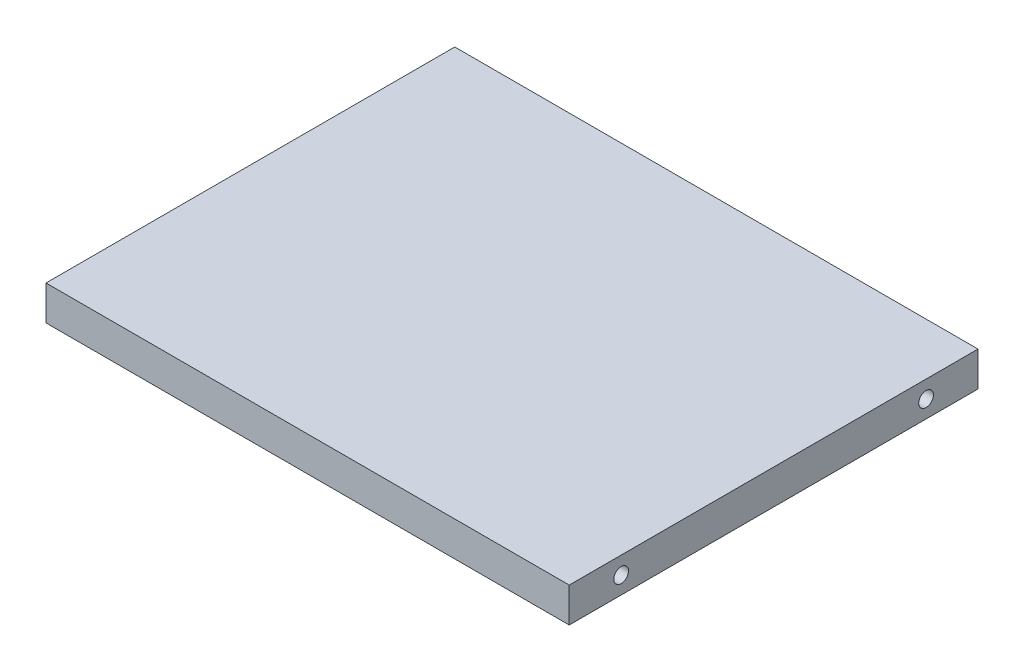
ISO-10303-21;
HEADER;
FILE_DESCRIPTION(('STEP AP214'),'2;1');
FILE_NAME('part.step','',(''),(''),'','','');
FILE_SCHEMA(('AUTOMOTIVE_DESIGN { 1 0 10303 214 1 1 1 1 }'));
ENDSEC;
DATA;
#1=APPLICATION_CONTEXT('core data for automotive mechanical design processes');
#2=APPLICATION_PROTOCOL_DEFINITION('international standard','automotive_design',2000,#1);
#3=PRODUCT_CONTEXT('',#1,'mechanical');
#4=PRODUCT('Part','Part','',(#3));
#5=PRODUCT_RELATED_PRODUCT_CATEGORY('part','',(#4));
#6=PRODUCT_DEFINITION_FORMATION('','',#4);
#7=PRODUCT_DEFINITION_CONTEXT('part definition',#1,'design');
#8=PRODUCT_DEFINITION('design','',#6,#7);
#9=PRODUCT_DEFINITION_SHAPE('','',#8);
#10=(LENGTH_UNIT() NAMED_UNIT(*) SI_UNIT(.MILLI.,.METRE.));
#11=(NAMED_UNIT(*) PLANE_ANGLE_UNIT() SI_UNIT($,.RADIAN.));
#12=(NAMED_UNIT(*) SI_UNIT($,.STERADIAN.) SOLID_ANGLE_UNIT());
#13=UNCERTAINTY_MEASURE_WITH_UNIT(LENGTH_MEASURE(1.E-05),#10,'distance_accuracy_value','');
#14=(GEOMETRIC_REPRESENTATION_CONTEXT(3) GLOBAL_UNCERTAINTY_ASSIGNED_CONTEXT((#13)) GLOBAL_UNIT_ASSIGNED_CONTEXT((#10,
#11,#12)) REPRESENTATION_CONTEXT('',''));
#15=CARTESIAN_POINT('',(0.,0.,0.));
#16=DIRECTION('',(0.,0.,1.));
#17=DIRECTION('',(1.,0.,0.));
#18=AXIS2_PLACEMENT_3D('',#15,#16,#17);
#19=CARTESIAN_POINT('',(96.,73.649999999999,-74.9999999999999));
#20=DIRECTION('',(1.,0.,0.));
#21=DIRECTION('',(0.,0.,-1.));
#22=AXIS2_PLACEMENT_3D('',#19,#20,#21);
#23=PLANE('',#22);
#24=CARTESIAN_POINT('',(96.,76.824999999999,-9.5249999999999));
#25=DIRECTION('',(1.,0.,0.));
#26=DIRECTION('',(0.,0.,-1.));
#27=AXIS2_PLACEMENT_3D('',#24,#25,#26);
#28=CIRCLE('',#27,1.35255);
#29=CARTESIAN_POINT('',(96.,76.824999999999,-10.8775499999999));
#30=VERTEX_POINT('',#29);
#31=EDGE_CURVE('E175',#30,#30,#28,.T.);
#32=ORIENTED_EDGE('',*,*,#31,.F.);
#33=EDGE_LOOP('',(#32));
#34=FACE_BOUND('',#33,.T.);
#35=CARTESIAN_POINT('',(96.,76.824999999999,-65.4749999999999));
#36=DIRECTION('',(1.,0.,0.));
#37=DIRECTION('',(0.,0.,-1.));
#38=AXIS2_PLACEMENT_3D('',#35,#36,#37);
#39=CIRCLE('',#38,1.35255);
#40=CARTESIAN_POINT('',(96.,76.824999999999,-66.8275499999998));
#41=VERTEX_POINT('',#40);
#42=EDGE_CURVE('E180',#41,#41,#39,.T.);
#43=ORIENTED_EDGE('',*,*,#42,.F.);
#44=EDGE_LOOP('',(#43));
#45=FACE_BOUND('',#44,.T.);
#46=DIRECTION('',(0.,0.,-1.));
#47=VECTOR('',#46,1.);
#48=CARTESIAN_POINT('',(96.,79.9999999999989,-74.9999999999999));
#49=LINE('',#48,#47);
#50=CARTESIAN_POINT('',(96.,79.9999999999989,0.));
#51=VERTEX_POINT('',#50);
#52=CARTESIAN_POINT('',(96.,79.9999999999989,-74.9999999999999));
#53=VERTEX_POINT('',#52);
#54=EDGE_CURVE('E98',#51,#53,#49,.T.);
#55=ORIENTED_EDGE('',*,*,#54,.F.);
#56=DIRECTION('',(0.,1.,0.));
#57=VECTOR('',#56,1.);
#58=CARTESIAN_POINT('',(96.,73.649999999999,0.));
#59=LINE('',#58,#57);
#60=CARTESIAN_POINT('',(96.,73.649999999999,0.));
#61=VERTEX_POINT('',#60);
#62=EDGE_CURVE('E11',#61,#51,#59,.T.);
#63=ORIENTED_EDGE('',*,*,#62,.F.);
#64=DIRECTION('',(0.,0.,-1.));
#65=VECTOR('',#64,1.);
#66=CARTESIAN_POINT('',(96.,73.649999999999,-74.9999999999999));
#67=LINE('',#66,#65);
#68=CARTESIAN_POINT('',(96.,73.649999999999,-74.9999999999999));
#69=VERTEX_POINT('',#68);
#70=EDGE_CURVE('E91',#61,#69,#67,.T.);
#71=ORIENTED_EDGE('',*,*,#70,.T.);
#72=DIRECTION('',(0.,1.,0.));
#73=VECTOR('',#72,1.);
#74=CARTESIAN_POINT('',(96.,73.649999999999,-74.9999999999999));
#75=LINE('',#74,#73);
#76=EDGE_CURVE('E36',#69,#53,#75,.T.);
#77=ORIENTED_EDGE('',*,*,#76,.T.);
#78=EDGE_LOOP('',(#55,#63,#71,#77));
#79=FACE_BOUND('',#78,.T.);
#80=ADVANCED_FACE('F33',(#34,#45,#79),#23,.T.);
#81=CARTESIAN_POINT('',(96.,73.649999999999,0.));
#82=DIRECTION('',(0.,0.,1.));
#83=DIRECTION('',(1.,0.,0.));
#84=AXIS2_PLACEMENT_3D('',#81,#82,#83);
#85=PLANE('',#84);
#86=DIRECTION('',(1.,0.,0.));
#87=VECTOR('',#86,1.);
#88=CARTESIAN_POINT('',(96.,79.9999999999989,0.));
#89=LINE('',#88,#87);
#90=CARTESIAN_POINT('',(0.,79.9999999999989,-1.06010989917027E-12));
#91=VERTEX_POINT('',#90);
#92=EDGE_CURVE('E93',#91,#51,#89,.T.);
#93=ORIENTED_EDGE('',*,*,#92,.F.);
#94=DIRECTION('',(0.,1.,0.));
#95=VECTOR('',#94,1.);
#96=CARTESIAN_POINT('',(0.,73.649999999999,-1.06010989917027E-12));
#97=LINE('',#96,#95);
#98=CARTESIAN_POINT('',(0.,73.649999999999,-1.06010989917027E-12));
#99=VERTEX_POINT('',#98);
#100=EDGE_CURVE('E42',#99,#91,#97,.T.);
#101=ORIENTED_EDGE('',*,*,#100,.F.);
#102=DIRECTION('',(1.,0.,0.));
#103=VECTOR('',#102,1.);
#104=CARTESIAN_POINT('',(96.,73.649999999999,0.));
#105=LINE('',#104,#103);
#106=EDGE_CURVE('E88',#99,#61,#105,.T.);
#107=ORIENTED_EDGE('',*,*,#106,.T.);
#108=ORIENTED_EDGE('',*,*,#62,.T.);
#109=EDGE_LOOP('',(#93,#101,#107,#108));
#110=FACE_BOUND('',#109,.T.);
#111=ADVANCED_FACE('F109',(#110),#85,.T.);
#112=CARTESIAN_POINT('',(0.,73.649999999999,-74.9999999999998));
#113=DIRECTION('',(-1.,0.,0.));
#114=DIRECTION('',(0.,0.,1.));
#115=AXIS2_PLACEMENT_3D('',#112,#113,#114);
#116=PLANE('',#115);
#117=CARTESIAN_POINT('',(0.,76.8249999999991,-9.5249999999978));
#118=DIRECTION('',(-1.,0.,0.));
#119=DIRECTION('',(0.,0.,1.));
#120=AXIS2_PLACEMENT_3D('',#117,#118,#119);
#121=CIRCLE('',#120,1.35255);
#122=CARTESIAN_POINT('',(0.,76.8249999999991,-8.1724499999978));
#123=VERTEX_POINT('',#122);
#124=EDGE_CURVE('E166',#123,#123,#121,.T.);
#125=ORIENTED_EDGE('',*,*,#124,.F.);
#126=EDGE_LOOP('',(#125));
#127=FACE_BOUND('',#126,.T.);
#128=CARTESIAN_POINT('',(0.,76.8249999999999,-65.4749999999977));
#129=DIRECTION('',(-1.,0.,0.));
#130=DIRECTION('',(0.,0.,1.));
#131=AXIS2_PLACEMENT_3D('',#128,#129,#130);
#132=CIRCLE('',#131,1.35255);
#133=CARTESIAN_POINT('',(0.,76.8249999999999,-64.1224499999978));
#134=VERTEX_POINT('',#133);
#135=EDGE_CURVE('E165',#134,#134,#132,.T.);
#136=ORIENTED_EDGE('',*,*,#135,.F.);
#137=EDGE_LOOP('',(#136));
#138=FACE_BOUND('',#137,.T.);
#139=DIRECTION('',(0.,0.,1.));
#140=VECTOR('',#139,1.);
#141=CARTESIAN_POINT('',(0.,79.9999999999989,-74.9999999999998));
#142=LINE('',#141,#140);
#143=CARTESIAN_POINT('',(0.,79.9999999999989,-74.9999999999998));
#144=VERTEX_POINT('',#143);
#145=EDGE_CURVE('E83',#144,#91,#142,.T.);
#146=ORIENTED_EDGE('',*,*,#145,.F.);
#147=DIRECTION('',(0.,1.,0.));
#148=VECTOR('',#147,1.);
#149=CARTESIAN_POINT('',(0.,73.649999999999,-74.9999999999998));
#150=LINE('',#149,#148);
#151=CARTESIAN_POINT('',(0.,73.649999999999,-74.9999999999998));
#152=VERTEX_POINT('',#151);
#153=EDGE_CURVE('E78',#152,#144,#150,.T.);
#154=ORIENTED_EDGE('',*,*,#153,.F.);
#155=DIRECTION('',(0.,0.,1.));
#156=VECTOR('',#155,1.);
#157=CARTESIAN_POINT('',(0.,73.649999999999,-74.9999999999998));
#158=LINE('',#157,#156);
#159=EDGE_CURVE('E81',#152,#99,#158,.T.);
#160=ORIENTED_EDGE('',*,*,#159,.T.);
#161=ORIENTED_EDGE('',*,*,#100,.T.);
#162=EDGE_LOOP('',(#146,#154,#160,#161));
#163=FACE_BOUND('',#162,.T.);
#164=ADVANCED_FACE('F80',(#127,#138,#163),#116,.T.);
#165=CARTESIAN_POINT('',(96.,73.649999999999,-74.9999999999999));
#166=DIRECTION('',(0.,0.,-1.));
#167=DIRECTION('',(-1.,0.,0.));
#168=AXIS2_PLACEMENT_3D('',#165,#166,#167);
#169=PLANE('',#168);
#170=DIRECTION('',(-1.,0.,0.));
#171=VECTOR('',#170,1.);
#172=CARTESIAN_POINT('',(96.,79.9999999999989,-74.9999999999999));
#173=LINE('',#172,#171);
#174=EDGE_CURVE('E101',#53,#144,#173,.T.);
#175=ORIENTED_EDGE('',*,*,#174,.F.);
#176=ORIENTED_EDGE('',*,*,#76,.F.);
#177=DIRECTION('',(-1.,0.,0.));
#178=VECTOR('',#177,1.);
#179=CARTESIAN_POINT('',(96.,73.649999999999,-74.9999999999999));
#180=LINE('',#179,#178);
#181=EDGE_CURVE('E87',#69,#152,#180,.T.);
#182=ORIENTED_EDGE('',*,*,#181,.T.);
#183=ORIENTED_EDGE('',*,*,#153,.T.);
#184=EDGE_LOOP('',(#175,#176,#182,#183));
#185=FACE_BOUND('',#184,.T.);
#186=ADVANCED_FACE('F90',(#185),#169,.T.);
#187=CARTESIAN_POINT('',(0.,73.649999999999,0.));
#188=DIRECTION('',(0.,-1.,0.));
#189=DIRECTION('',(0.,0.,-1.));
#190=AXIS2_PLACEMENT_3D('',#187,#188,#189);
#191=PLANE('',#190);
#192=ORIENTED_EDGE('',*,*,#70,.F.);
#193=ORIENTED_EDGE('',*,*,#106,.F.);
#194=ORIENTED_EDGE('',*,*,#159,.F.);
#195=ORIENTED_EDGE('',*,*,#181,.F.);
#196=EDGE_LOOP('',(#192,#193,#194,#195));
#197=FACE_BOUND('',#196,.T.);
#198=ADVANCED_FACE('F86',(#197),#191,.T.);
#199=CARTESIAN_POINT('',(0.,79.9999999999989,0.));
#200=DIRECTION('',(0.,-1.,0.));
#201=DIRECTION('',(0.,0.,-1.));
#202=AXIS2_PLACEMENT_3D('',#199,#200,#201);
#203=PLANE('',#202);
#204=ORIENTED_EDGE('',*,*,#54,.T.);
#205=ORIENTED_EDGE('',*,*,#174,.T.);
#206=ORIENTED_EDGE('',*,*,#145,.T.);
#207=ORIENTED_EDGE('',*,*,#92,.T.);
#208=EDGE_LOOP('',(#204,#205,#206,#207));
#209=FACE_BOUND('',#208,.T.);
#210=ADVANCED_FACE('F108',(#209),#203,.F.);
#211=CARTESIAN_POINT('',(86.475,76.824999999999,-65.4749999999999));
#212=DIRECTION('',(1.,0.,0.));
#213=DIRECTION('',(0.,0.,-1.));
#214=AXIS2_PLACEMENT_3D('',#211,#212,#213);
#215=CYLINDRICAL_SURFACE('',#214,1.35255);
#216=CARTESIAN_POINT('',(86.475,76.824999999999,-65.4749999999999));
#217=DIRECTION('',(1.,0.,0.));
#218=DIRECTION('',(0.,0.,-1.));
#219=AXIS2_PLACEMENT_3D('',#216,#217,#218);
#220=CIRCLE('',#219,1.35255);
#221=CARTESIAN_POINT('',(86.475,76.824999999999,-66.8275499999998));
#222=VERTEX_POINT('',#221);
#223=EDGE_CURVE('E102',#222,#222,#220,.T.);
#224=ORIENTED_EDGE('',*,*,#223,.F.);
#225=EDGE_LOOP('',(#224));
#226=FACE_BOUND('',#225,.T.);
#227=ORIENTED_EDGE('',*,*,#42,.T.);
#228=EDGE_LOOP('',(#227));
#229=FACE_BOUND('',#228,.T.);
#230=ADVANCED_FACE('F128',(#226,#229),#215,.F.);
#231=CARTESIAN_POINT('',(86.475,76.824999999999,-65.4749999999999));
#232=DIRECTION('',(1.,0.,0.));
#233=DIRECTION('',(0.,0.,-1.));
#234=AXIS2_PLACEMENT_3D('',#231,#232,#233);
#235=PLANE('',#234);
#236=ORIENTED_EDGE('',*,*,#223,.T.);
#237=EDGE_LOOP('',(#236));
#238=FACE_BOUND('',#237,.T.);
#239=ADVANCED_FACE('F132',(#238),#235,.T.);
#240=CARTESIAN_POINT('',(86.475,76.824999999999,-9.5249999999999));
#241=DIRECTION('',(1.,0.,0.));
#242=DIRECTION('',(0.,0.,-1.));
#243=AXIS2_PLACEMENT_3D('',#240,#241,#242);
#244=CYLINDRICAL_SURFACE('',#243,1.35255);
#245=CARTESIAN_POINT('',(86.475,76.824999999999,-9.5249999999999));
#246=DIRECTION('',(1.,0.,0.));
#247=DIRECTION('',(0.,0.,-1.));
#248=AXIS2_PLACEMENT_3D('',#245,#246,#247);
#249=CIRCLE('',#248,1.35255);
#250=CARTESIAN_POINT('',(86.475,76.824999999999,-10.8775499999999));
#251=VERTEX_POINT('',#250);
#252=EDGE_CURVE('E177',#251,#251,#249,.T.);
#253=ORIENTED_EDGE('',*,*,#252,.F.);
#254=EDGE_LOOP('',(#253));
#255=FACE_BOUND('',#254,.T.);
#256=ORIENTED_EDGE('',*,*,#31,.T.);
#257=EDGE_LOOP('',(#256));
#258=FACE_BOUND('',#257,.T.);
#259=ADVANCED_FACE('F136',(#255,#258),#244,.F.);
#260=CARTESIAN_POINT('',(86.475,76.824999999999,-9.5249999999999));
#261=DIRECTION('',(1.,0.,0.));
#262=DIRECTION('',(0.,0.,-1.));
#263=AXIS2_PLACEMENT_3D('',#260,#261,#262);
#264=PLANE('',#263);
#265=ORIENTED_EDGE('',*,*,#252,.T.);
#266=EDGE_LOOP('',(#265));
#267=FACE_BOUND('',#266,.T.);
#268=ADVANCED_FACE('F140',(#267),#264,.T.);
#269=CARTESIAN_POINT('',(9.525,76.8249999999999,-65.4749999999977));
#270=DIRECTION('',(-1.,0.,0.));
#271=DIRECTION('',(0.,0.,1.));
#272=AXIS2_PLACEMENT_3D('',#269,#270,#271);
#273=CYLINDRICAL_SURFACE('',#272,1.35255);
#274=CARTESIAN_POINT('',(9.525,76.8249999999999,-65.4749999999977));
#275=DIRECTION('',(-1.,0.,0.));
#276=DIRECTION('',(0.,0.,1.));
#277=AXIS2_PLACEMENT_3D('',#274,#275,#276);
#278=CIRCLE('',#277,1.35255);
#279=CARTESIAN_POINT('',(9.525,76.8249999999999,-64.1224499999978));
#280=VERTEX_POINT('',#279);
#281=EDGE_CURVE('E169',#280,#280,#278,.T.);
#282=ORIENTED_EDGE('',*,*,#281,.F.);
#283=EDGE_LOOP('',(#282));
#284=FACE_BOUND('',#283,.T.);
#285=ORIENTED_EDGE('',*,*,#135,.T.);
#286=EDGE_LOOP('',(#285));
#287=FACE_BOUND('',#286,.T.);
#288=ADVANCED_FACE('F144',(#284,#287),#273,.F.);
#289=CARTESIAN_POINT('',(9.525,76.8249999999999,-65.4749999999977));
#290=DIRECTION('',(-1.,0.,0.));
#291=DIRECTION('',(0.,0.,1.));
#292=AXIS2_PLACEMENT_3D('',#289,#290,#291);
#293=PLANE('',#292);
#294=ORIENTED_EDGE('',*,*,#281,.T.);
#295=EDGE_LOOP('',(#294));
#296=FACE_BOUND('',#295,.T.);
#297=ADVANCED_FACE('F148',(#296),#293,.T.);
#298=CARTESIAN_POINT('',(9.525,76.8249999999991,-9.5249999999978));
#299=DIRECTION('',(-1.,0.,0.));
#300=DIRECTION('',(0.,0.,1.));
#301=AXIS2_PLACEMENT_3D('',#298,#299,#300);
#302=CYLINDRICAL_SURFACE('',#301,1.35255);
#303=CARTESIAN_POINT('',(9.525,76.8249999999991,-9.5249999999978));
#304=DIRECTION('',(-1.,0.,0.));
#305=DIRECTION('',(0.,0.,1.));
#306=AXIS2_PLACEMENT_3D('',#303,#304,#305);
#307=CIRCLE('',#306,1.35255);
#308=CARTESIAN_POINT('',(9.525,76.8249999999991,-8.1724499999978));
#309=VERTEX_POINT('',#308);
#310=EDGE_CURVE('E164',#309,#309,#307,.T.);
#311=ORIENTED_EDGE('',*,*,#310,.F.);
#312=EDGE_LOOP('',(#311));
#313=FACE_BOUND('',#312,.T.);
#314=ORIENTED_EDGE('',*,*,#124,.T.);
#315=EDGE_LOOP('',(#314));
#316=FACE_BOUND('',#315,.T.);
#317=ADVANCED_FACE('F152',(#313,#316),#302,.F.);
#318=CARTESIAN_POINT('',(9.525,76.8249999999991,-9.5249999999978));
#319=DIRECTION('',(-1.,0.,0.));
#320=DIRECTION('',(0.,0.,1.));
#321=AXIS2_PLACEMENT_3D('',#318,#319,#320);
#322=PLANE('',#321);
#323=ORIENTED_EDGE('',*,*,#310,.T.);
#324=EDGE_LOOP('',(#323));
#325=FACE_BOUND('',#324,.T.);
#326=ADVANCED_FACE('F156',(#325),#322,.T.);
#327=CLOSED_SHELL('',(#80,#111,#164,#186,#198,#210,#230,#239,#259,#268,#288,#297,#317,#326));
#328=MANIFOLD_SOLID_BREP('B2',#327);
#329=ADVANCED_BREP_SHAPE_REPRESENTATION('',(#18,#328),#14);
#330=SHAPE_DEFINITION_REPRESENTATION(#9,#329);
ENDSEC;
END-ISO-10303-21;
